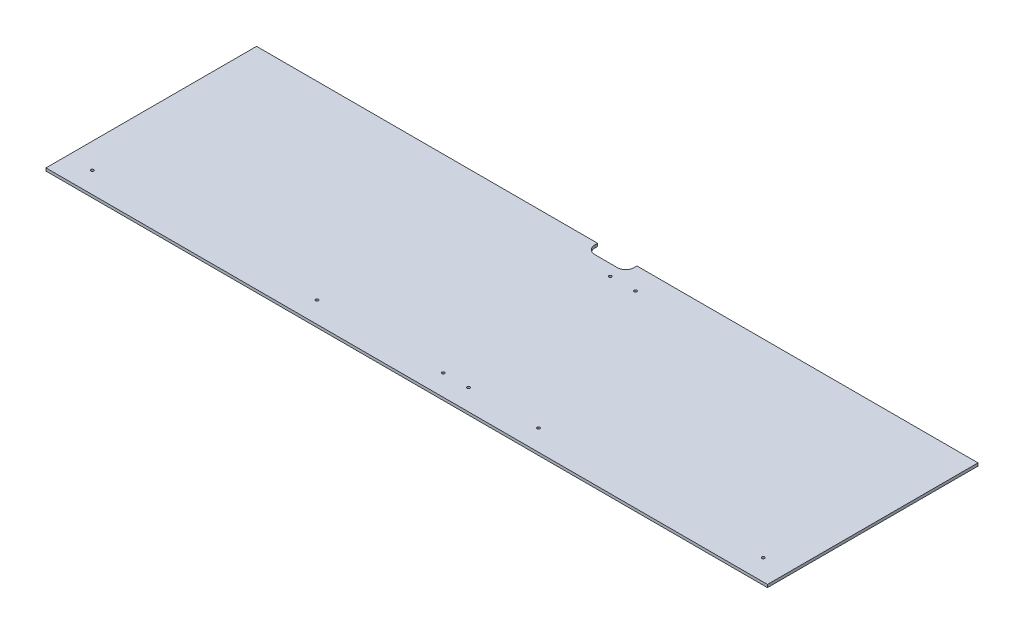
ISO-10303-21;
HEADER;
FILE_DESCRIPTION(('STEP AP214'),'2;1');
FILE_NAME('part.step','',(''),(''),'','','');
FILE_SCHEMA(('AUTOMOTIVE_DESIGN { 1 0 10303 214 1 1 1 1 }'));
ENDSEC;
DATA;
#1=APPLICATION_CONTEXT('core data for automotive mechanical design processes');
#2=APPLICATION_PROTOCOL_DEFINITION('international standard','automotive_design',2000,#1);
#3=PRODUCT_CONTEXT('',#1,'mechanical');
#4=PRODUCT('Part','Part','',(#3));
#5=PRODUCT_RELATED_PRODUCT_CATEGORY('part','',(#4));
#6=PRODUCT_DEFINITION_FORMATION('','',#4);
#7=PRODUCT_DEFINITION_CONTEXT('part definition',#1,'design');
#8=PRODUCT_DEFINITION('design','',#6,#7);
#9=PRODUCT_DEFINITION_SHAPE('','',#8);
#10=(LENGTH_UNIT() NAMED_UNIT(*) SI_UNIT(.MILLI.,.METRE.));
#11=(NAMED_UNIT(*) PLANE_ANGLE_UNIT() SI_UNIT($,.RADIAN.));
#12=(NAMED_UNIT(*) SI_UNIT($,.STERADIAN.) SOLID_ANGLE_UNIT());
#13=UNCERTAINTY_MEASURE_WITH_UNIT(LENGTH_MEASURE(1.E-05),#10,'distance_accuracy_value','');
#14=(GEOMETRIC_REPRESENTATION_CONTEXT(3) GLOBAL_UNCERTAINTY_ASSIGNED_CONTEXT((#13)) GLOBAL_UNIT_ASSIGNED_CONTEXT((#10,
#11,#12)) REPRESENTATION_CONTEXT('',''));
#15=CARTESIAN_POINT('',(0.,0.,0.));
#16=DIRECTION('',(0.,0.,1.));
#17=DIRECTION('',(1.,0.,0.));
#18=AXIS2_PLACEMENT_3D('',#15,#16,#17);
#19=CARTESIAN_POINT('',(815.975,-6.35,238.125));
#20=DIRECTION('',(0.,-1.,0.));
#21=DIRECTION('',(0.,0.,-1.));
#22=AXIS2_PLACEMENT_3D('',#19,#20,#21);
#23=PLANE('',#22);
#24=DIRECTION('',(-1.,0.,0.));
#25=VECTOR('',#24,1.);
#26=CARTESIAN_POINT('',(818.778398267125,-6.35,25.4));
#27=LINE('',#26,#25);
#28=CARTESIAN_POINT('',(841.375,-6.35,25.4));
#29=VERTEX_POINT('',#28);
#30=CARTESIAN_POINT('',(790.575,-6.35,25.4));
#31=VERTEX_POINT('',#30);
#32=EDGE_CURVE('E92',#29,#31,#27,.T.);
#33=ORIENTED_EDGE('',*,*,#32,.F.);
#34=CARTESIAN_POINT('',(841.375,-6.35,6.35));
#35=DIRECTION('',(0.,1.,0.));
#36=DIRECTION('',(0.,0.,1.));
#37=AXIS2_PLACEMENT_3D('',#34,#35,#36);
#38=CIRCLE('',#37,19.05);
#39=CARTESIAN_POINT('',(860.425,-6.35,6.35));
#40=VERTEX_POINT('',#39);
#41=EDGE_CURVE('E112',#29,#40,#38,.T.);
#42=ORIENTED_EDGE('',*,*,#41,.T.);
#43=DIRECTION('',(0.,0.,-1.));
#44=VECTOR('',#43,1.);
#45=CARTESIAN_POINT('',(860.425,-6.35,12.7));
#46=LINE('',#45,#44);
#47=CARTESIAN_POINT('',(860.425,-6.35,0.));
#48=VERTEX_POINT('',#47);
#49=EDGE_CURVE('E165',#40,#48,#46,.T.);
#50=ORIENTED_EDGE('',*,*,#49,.T.);
#51=DIRECTION('',(1.,0.,0.));
#52=VECTOR('',#51,1.);
#53=CARTESIAN_POINT('',(815.975,-6.35,0.));
#54=LINE('',#53,#52);
#55=CARTESIAN_POINT('',(1631.95,-6.35,0.));
#56=VERTEX_POINT('',#55);
#57=EDGE_CURVE('E162',#48,#56,#54,.T.);
#58=ORIENTED_EDGE('',*,*,#57,.T.);
#59=DIRECTION('',(0.,0.,1.));
#60=VECTOR('',#59,1.);
#61=CARTESIAN_POINT('',(1631.95,-6.35,238.125));
#62=LINE('',#61,#60);
#63=CARTESIAN_POINT('',(1631.95,-6.35,476.25));
#64=VERTEX_POINT('',#63);
#65=EDGE_CURVE('E175',#56,#64,#62,.T.);
#66=ORIENTED_EDGE('',*,*,#65,.T.);
#67=DIRECTION('',(1.,0.,0.));
#68=VECTOR('',#67,1.);
#69=CARTESIAN_POINT('',(815.975,-6.35,476.25));
#70=LINE('',#69,#68);
#71=CARTESIAN_POINT('',(0.,-6.35,476.25));
#72=VERTEX_POINT('',#71);
#73=EDGE_CURVE('E151',#72,#64,#70,.T.);
#74=ORIENTED_EDGE('',*,*,#73,.F.);
#75=DIRECTION('',(0.,0.,1.));
#76=VECTOR('',#75,1.);
#77=CARTESIAN_POINT('',(0.,-6.35,238.125));
#78=LINE('',#77,#76);
#79=CARTESIAN_POINT('',(0.,-6.35,0.));
#80=VERTEX_POINT('',#79);
#81=EDGE_CURVE('E141',#80,#72,#78,.T.);
#82=ORIENTED_EDGE('',*,*,#81,.F.);
#83=DIRECTION('',(1.,0.,0.));
#84=VECTOR('',#83,1.);
#85=CARTESIAN_POINT('',(815.975,-6.35,0.));
#86=LINE('',#85,#84);
#87=CARTESIAN_POINT('',(771.525,-6.35,0.));
#88=VERTEX_POINT('',#87);
#89=EDGE_CURVE('E131',#80,#88,#86,.T.);
#90=ORIENTED_EDGE('',*,*,#89,.T.);
#91=DIRECTION('',(0.,0.,-1.));
#92=VECTOR('',#91,1.);
#93=CARTESIAN_POINT('',(771.525,-6.35,12.7));
#94=LINE('',#93,#92);
#95=CARTESIAN_POINT('',(771.525,-6.35,6.35));
#96=VERTEX_POINT('',#95);
#97=EDGE_CURVE('E87',#96,#88,#94,.T.);
#98=ORIENTED_EDGE('',*,*,#97,.F.);
#99=CARTESIAN_POINT('',(790.575,-6.35,6.35));
#100=DIRECTION('',(0.,-1.,0.));
#101=DIRECTION('',(0.,0.,-1.));
#102=AXIS2_PLACEMENT_3D('',#99,#100,#101);
#103=CIRCLE('',#102,19.05);
#104=EDGE_CURVE('E100',#96,#31,#103,.F.);
#105=ORIENTED_EDGE('',*,*,#104,.T.);
#106=EDGE_LOOP('',(#33,#42,#50,#58,#66,#74,#82,#90,#98,#105));
#107=FACE_BOUND('',#106,.T.);
#108=CARTESIAN_POINT('',(57.15,-6.3500000000003,428.625));
#109=DIRECTION('',(0.,-1.,0.));
#110=DIRECTION('',(0.,0.,-1.));
#111=AXIS2_PLACEMENT_3D('',#108,#109,#110);
#112=CIRCLE('',#111,3.175);
#113=CARTESIAN_POINT('',(57.15,-6.3500000000003,425.45));
#114=VERTEX_POINT('',#113);
#115=EDGE_CURVE('E178',#114,#114,#112,.F.);
#116=ORIENTED_EDGE('',*,*,#115,.T.);
#117=EDGE_LOOP('',(#116));
#118=FACE_BOUND('',#117,.T.);
#119=CARTESIAN_POINT('',(565.15,-6.3500000000003,428.625));
#120=DIRECTION('',(0.,-1.,0.));
#121=DIRECTION('',(0.,0.,-1.));
#122=AXIS2_PLACEMENT_3D('',#119,#120,#121);
#123=CIRCLE('',#122,3.175);
#124=CARTESIAN_POINT('',(565.15,-6.3500000000003,425.45));
#125=VERTEX_POINT('',#124);
#126=EDGE_CURVE('E224',#125,#125,#123,.F.);
#127=ORIENTED_EDGE('',*,*,#126,.T.);
#128=EDGE_LOOP('',(#127));
#129=FACE_BOUND('',#128,.T.);
#130=CARTESIAN_POINT('',(850.9,-6.3500000000003,428.625));
#131=DIRECTION('',(0.,-1.,0.));
#132=DIRECTION('',(0.,0.,-1.));
#133=AXIS2_PLACEMENT_3D('',#130,#131,#132);
#134=CIRCLE('',#133,3.175);
#135=CARTESIAN_POINT('',(850.9,-6.3500000000003,425.45));
#136=VERTEX_POINT('',#135);
#137=EDGE_CURVE('E227',#136,#136,#134,.F.);
#138=ORIENTED_EDGE('',*,*,#137,.T.);
#139=EDGE_LOOP('',(#138));
#140=FACE_BOUND('',#139,.T.);
#141=CARTESIAN_POINT('',(908.05,-6.3500000000003,428.625));
#142=DIRECTION('',(0.,-1.,0.));
#143=DIRECTION('',(0.,0.,-1.));
#144=AXIS2_PLACEMENT_3D('',#141,#142,#143);
#145=CIRCLE('',#144,3.175);
#146=CARTESIAN_POINT('',(908.05,-6.3500000000003,425.45));
#147=VERTEX_POINT('',#146);
#148=EDGE_CURVE('E230',#147,#147,#145,.F.);
#149=ORIENTED_EDGE('',*,*,#148,.T.);
#150=EDGE_LOOP('',(#149));
#151=FACE_BOUND('',#150,.T.);
#152=CARTESIAN_POINT('',(1066.8,-6.3500000000003,428.625));
#153=DIRECTION('',(0.,-1.,0.));
#154=DIRECTION('',(0.,0.,-1.));
#155=AXIS2_PLACEMENT_3D('',#152,#153,#154);
#156=CIRCLE('',#155,3.175);
#157=CARTESIAN_POINT('',(1066.8,-6.3500000000003,425.45));
#158=VERTEX_POINT('',#157);
#159=EDGE_CURVE('E233',#158,#158,#156,.F.);
#160=ORIENTED_EDGE('',*,*,#159,.T.);
#161=EDGE_LOOP('',(#160));
#162=FACE_BOUND('',#161,.T.);
#163=CARTESIAN_POINT('',(1574.8,-6.3500000000003,428.625));
#164=DIRECTION('',(0.,-1.,0.));
#165=DIRECTION('',(0.,0.,-1.));
#166=AXIS2_PLACEMENT_3D('',#163,#164,#165);
#167=CIRCLE('',#166,3.175);
#168=CARTESIAN_POINT('',(1574.8,-6.3500000000003,425.45));
#169=VERTEX_POINT('',#168);
#170=EDGE_CURVE('E236',#169,#169,#167,.F.);
#171=ORIENTED_EDGE('',*,*,#170,.T.);
#172=EDGE_LOOP('',(#171));
#173=FACE_BOUND('',#172,.T.);
#174=CARTESIAN_POINT('',(908.05,-6.3500000000003,50.8));
#175=DIRECTION('',(0.,-1.,0.));
#176=DIRECTION('',(0.,0.,-1.));
#177=AXIS2_PLACEMENT_3D('',#174,#175,#176);
#178=CIRCLE('',#177,3.175);
#179=CARTESIAN_POINT('',(908.05,-6.3500000000003,47.625));
#180=VERTEX_POINT('',#179);
#181=EDGE_CURVE('E238',#180,#180,#178,.F.);
#182=ORIENTED_EDGE('',*,*,#181,.T.);
#183=EDGE_LOOP('',(#182));
#184=FACE_BOUND('',#183,.T.);
#185=CARTESIAN_POINT('',(850.9,-6.3500000000003,50.8));
#186=DIRECTION('',(0.,-1.,0.));
#187=DIRECTION('',(0.,0.,-1.));
#188=AXIS2_PLACEMENT_3D('',#185,#186,#187);
#189=CIRCLE('',#188,3.175);
#190=CARTESIAN_POINT('',(850.9,-6.3500000000003,47.625));
#191=VERTEX_POINT('',#190);
#192=EDGE_CURVE('E17',#191,#191,#189,.F.);
#193=ORIENTED_EDGE('',*,*,#192,.T.);
#194=EDGE_LOOP('',(#193));
#195=FACE_BOUND('',#194,.T.);
#196=ADVANCED_FACE('F14',(#107,#118,#129,#140,#151,#162,#173,#184,#195),#23,.T.);
#197=CARTESIAN_POINT('',(850.9,-7227.09274295138,50.8));
#198=DIRECTION('',(0.,-1.,0.));
#199=DIRECTION('',(0.,0.,-1.));
#200=AXIS2_PLACEMENT_3D('',#197,#198,#199);
#201=CYLINDRICAL_SURFACE('',#200,3.175);
#202=CARTESIAN_POINT('',(850.9,0.,50.8));
#203=DIRECTION('',(0.,-1.,0.));
#204=DIRECTION('',(0.,0.,-1.));
#205=AXIS2_PLACEMENT_3D('',#202,#203,#204);
#206=CIRCLE('',#205,3.175);
#207=CARTESIAN_POINT('',(850.9,0.,47.625));
#208=VERTEX_POINT('',#207);
#209=EDGE_CURVE('E218',#208,#208,#206,.F.);
#210=ORIENTED_EDGE('',*,*,#209,.T.);
#211=EDGE_LOOP('',(#210));
#212=FACE_BOUND('',#211,.T.);
#213=ORIENTED_EDGE('',*,*,#192,.F.);
#214=EDGE_LOOP('',(#213));
#215=FACE_BOUND('',#214,.T.);
#216=ADVANCED_FACE('F246',(#212,#215),#201,.F.);
#217=CARTESIAN_POINT('',(908.05,-7227.09274295138,50.8));
#218=DIRECTION('',(0.,-1.,0.));
#219=DIRECTION('',(0.,0.,-1.));
#220=AXIS2_PLACEMENT_3D('',#217,#218,#219);
#221=CYLINDRICAL_SURFACE('',#220,3.175);
#222=CARTESIAN_POINT('',(908.05,0.,50.8));
#223=DIRECTION('',(0.,-1.,0.));
#224=DIRECTION('',(0.,0.,-1.));
#225=AXIS2_PLACEMENT_3D('',#222,#223,#224);
#226=CIRCLE('',#225,3.175);
#227=CARTESIAN_POINT('',(908.05,0.,47.625));
#228=VERTEX_POINT('',#227);
#229=EDGE_CURVE('E215',#228,#228,#226,.F.);
#230=ORIENTED_EDGE('',*,*,#229,.T.);
#231=EDGE_LOOP('',(#230));
#232=FACE_BOUND('',#231,.T.);
#233=ORIENTED_EDGE('',*,*,#181,.F.);
#234=EDGE_LOOP('',(#233));
#235=FACE_BOUND('',#234,.T.);
#236=ADVANCED_FACE('F248',(#232,#235),#221,.F.);
#237=CARTESIAN_POINT('',(1574.8,-7227.09274295138,428.625));
#238=DIRECTION('',(0.,-1.,0.));
#239=DIRECTION('',(0.,0.,-1.));
#240=AXIS2_PLACEMENT_3D('',#237,#238,#239);
#241=CYLINDRICAL_SURFACE('',#240,3.175);
#242=CARTESIAN_POINT('',(1574.8,0.,428.625));
#243=DIRECTION('',(0.,-1.,0.));
#244=DIRECTION('',(0.,0.,-1.));
#245=AXIS2_PLACEMENT_3D('',#242,#243,#244);
#246=CIRCLE('',#245,3.175);
#247=CARTESIAN_POINT('',(1574.8,0.,425.45));
#248=VERTEX_POINT('',#247);
#249=EDGE_CURVE('E212',#248,#248,#246,.F.);
#250=ORIENTED_EDGE('',*,*,#249,.T.);
#251=EDGE_LOOP('',(#250));
#252=FACE_BOUND('',#251,.T.);
#253=ORIENTED_EDGE('',*,*,#170,.F.);
#254=EDGE_LOOP('',(#253));
#255=FACE_BOUND('',#254,.T.);
#256=ADVANCED_FACE('F255',(#252,#255),#241,.F.);
#257=CARTESIAN_POINT('',(1066.8,-7227.09274295138,428.625));
#258=DIRECTION('',(0.,-1.,0.));
#259=DIRECTION('',(0.,0.,-1.));
#260=AXIS2_PLACEMENT_3D('',#257,#258,#259);
#261=CYLINDRICAL_SURFACE('',#260,3.175);
#262=CARTESIAN_POINT('',(1066.8,0.,428.625));
#263=DIRECTION('',(0.,-1.,0.));
#264=DIRECTION('',(0.,0.,-1.));
#265=AXIS2_PLACEMENT_3D('',#262,#263,#264);
#266=CIRCLE('',#265,3.175);
#267=CARTESIAN_POINT('',(1066.8,0.,425.45));
#268=VERTEX_POINT('',#267);
#269=EDGE_CURVE('E209',#268,#268,#266,.F.);
#270=ORIENTED_EDGE('',*,*,#269,.T.);
#271=EDGE_LOOP('',(#270));
#272=FACE_BOUND('',#271,.T.);
#273=ORIENTED_EDGE('',*,*,#159,.F.);
#274=EDGE_LOOP('',(#273));
#275=FACE_BOUND('',#274,.T.);
#276=ADVANCED_FACE('F317',(#272,#275),#261,.F.);
#277=CARTESIAN_POINT('',(908.05,-7227.09274295138,428.625));
#278=DIRECTION('',(0.,-1.,0.));
#279=DIRECTION('',(0.,0.,-1.));
#280=AXIS2_PLACEMENT_3D('',#277,#278,#279);
#281=CYLINDRICAL_SURFACE('',#280,3.175);
#282=CARTESIAN_POINT('',(908.05,0.,428.625));
#283=DIRECTION('',(0.,-1.,0.));
#284=DIRECTION('',(0.,0.,-1.));
#285=AXIS2_PLACEMENT_3D('',#282,#283,#284);
#286=CIRCLE('',#285,3.175);
#287=CARTESIAN_POINT('',(908.05,0.,425.45));
#288=VERTEX_POINT('',#287);
#289=EDGE_CURVE('E206',#288,#288,#286,.F.);
#290=ORIENTED_EDGE('',*,*,#289,.T.);
#291=EDGE_LOOP('',(#290));
#292=FACE_BOUND('',#291,.T.);
#293=ORIENTED_EDGE('',*,*,#148,.F.);
#294=EDGE_LOOP('',(#293));
#295=FACE_BOUND('',#294,.T.);
#296=ADVANCED_FACE('F313',(#292,#295),#281,.F.);
#297=CARTESIAN_POINT('',(850.9,-7227.09274295138,428.625));
#298=DIRECTION('',(0.,-1.,0.));
#299=DIRECTION('',(0.,0.,-1.));
#300=AXIS2_PLACEMENT_3D('',#297,#298,#299);
#301=CYLINDRICAL_SURFACE('',#300,3.175);
#302=CARTESIAN_POINT('',(850.9,0.,428.625));
#303=DIRECTION('',(0.,-1.,0.));
#304=DIRECTION('',(0.,0.,-1.));
#305=AXIS2_PLACEMENT_3D('',#302,#303,#304);
#306=CIRCLE('',#305,3.175);
#307=CARTESIAN_POINT('',(850.9,0.,425.45));
#308=VERTEX_POINT('',#307);
#309=EDGE_CURVE('E203',#308,#308,#306,.F.);
#310=ORIENTED_EDGE('',*,*,#309,.T.);
#311=EDGE_LOOP('',(#310));
#312=FACE_BOUND('',#311,.T.);
#313=ORIENTED_EDGE('',*,*,#137,.F.);
#314=EDGE_LOOP('',(#313));
#315=FACE_BOUND('',#314,.T.);
#316=ADVANCED_FACE('F309',(#312,#315),#301,.F.);
#317=CARTESIAN_POINT('',(565.15,-7227.09274295138,428.625));
#318=DIRECTION('',(0.,-1.,0.));
#319=DIRECTION('',(0.,0.,-1.));
#320=AXIS2_PLACEMENT_3D('',#317,#318,#319);
#321=CYLINDRICAL_SURFACE('',#320,3.175);
#322=CARTESIAN_POINT('',(565.15,0.,428.625));
#323=DIRECTION('',(0.,-1.,0.));
#324=DIRECTION('',(0.,0.,-1.));
#325=AXIS2_PLACEMENT_3D('',#322,#323,#324);
#326=CIRCLE('',#325,3.175);
#327=CARTESIAN_POINT('',(565.15,0.,425.45));
#328=VERTEX_POINT('',#327);
#329=EDGE_CURVE('E200',#328,#328,#326,.F.);
#330=ORIENTED_EDGE('',*,*,#329,.T.);
#331=EDGE_LOOP('',(#330));
#332=FACE_BOUND('',#331,.T.);
#333=ORIENTED_EDGE('',*,*,#126,.F.);
#334=EDGE_LOOP('',(#333));
#335=FACE_BOUND('',#334,.T.);
#336=ADVANCED_FACE('F305',(#332,#335),#321,.F.);
#337=CARTESIAN_POINT('',(57.15,-7227.09274295138,428.625));
#338=DIRECTION('',(0.,-1.,0.));
#339=DIRECTION('',(0.,0.,-1.));
#340=AXIS2_PLACEMENT_3D('',#337,#338,#339);
#341=CYLINDRICAL_SURFACE('',#340,3.175);
#342=CARTESIAN_POINT('',(57.15,0.,428.625));
#343=DIRECTION('',(0.,-1.,0.));
#344=DIRECTION('',(0.,0.,-1.));
#345=AXIS2_PLACEMENT_3D('',#342,#343,#344);
#346=CIRCLE('',#345,3.175);
#347=CARTESIAN_POINT('',(57.15,0.,425.45));
#348=VERTEX_POINT('',#347);
#349=EDGE_CURVE('E156',#348,#348,#346,.F.);
#350=ORIENTED_EDGE('',*,*,#349,.T.);
#351=EDGE_LOOP('',(#350));
#352=FACE_BOUND('',#351,.T.);
#353=ORIENTED_EDGE('',*,*,#115,.F.);
#354=EDGE_LOOP('',(#353));
#355=FACE_BOUND('',#354,.T.);
#356=ADVANCED_FACE('F301',(#352,#355),#341,.F.);
#357=CARTESIAN_POINT('',(1631.95,-6.35,238.125));
#358=DIRECTION('',(-1.,0.,0.));
#359=DIRECTION('',(0.,0.,1.));
#360=AXIS2_PLACEMENT_3D('',#357,#358,#359);
#361=PLANE('',#360);
#362=DIRECTION('',(0.,1.,0.));
#363=VECTOR('',#362,1.);
#364=CARTESIAN_POINT('',(1631.95,-6.35,476.25));
#365=LINE('',#364,#363);
#366=CARTESIAN_POINT('',(1631.95,0.,476.25));
#367=VERTEX_POINT('',#366);
#368=EDGE_CURVE('E149',#64,#367,#365,.T.);
#369=ORIENTED_EDGE('',*,*,#368,.F.);
#370=ORIENTED_EDGE('',*,*,#65,.F.);
#371=DIRECTION('',(0.,1.,0.));
#372=VECTOR('',#371,1.);
#373=CARTESIAN_POINT('',(1631.95,-6.35,0.));
#374=LINE('',#373,#372);
#375=CARTESIAN_POINT('',(1631.95,0.,0.));
#376=VERTEX_POINT('',#375);
#377=EDGE_CURVE('E159',#56,#376,#374,.T.);
#378=ORIENTED_EDGE('',*,*,#377,.T.);
#379=DIRECTION('',(0.,0.,-1.));
#380=VECTOR('',#379,1.);
#381=CARTESIAN_POINT('',(1631.95,0.,238.125));
#382=LINE('',#381,#380);
#383=EDGE_CURVE('E146',#376,#367,#382,.F.);
#384=ORIENTED_EDGE('',*,*,#383,.T.);
#385=EDGE_LOOP('',(#369,#370,#378,#384));
#386=FACE_BOUND('',#385,.T.);
#387=ADVANCED_FACE('F297',(#386),#361,.F.);
#388=CARTESIAN_POINT('',(815.975,-6.35,476.25));
#389=DIRECTION('',(0.,0.,1.));
#390=DIRECTION('',(1.,0.,0.));
#391=AXIS2_PLACEMENT_3D('',#388,#389,#390);
#392=PLANE('',#391);
#393=ORIENTED_EDGE('',*,*,#73,.T.);
#394=ORIENTED_EDGE('',*,*,#368,.T.);
#395=DIRECTION('',(1.,0.,0.));
#396=VECTOR('',#395,1.);
#397=CARTESIAN_POINT('',(815.975,0.,476.25));
#398=LINE('',#397,#396);
#399=CARTESIAN_POINT('',(0.,0.,476.25));
#400=VERTEX_POINT('',#399);
#401=EDGE_CURVE('E137',#367,#400,#398,.F.);
#402=ORIENTED_EDGE('',*,*,#401,.T.);
#403=DIRECTION('',(0.,1.,0.));
#404=VECTOR('',#403,1.);
#405=CARTESIAN_POINT('',(0.,-6.35,476.25));
#406=LINE('',#405,#404);
#407=EDGE_CURVE('E132',#72,#400,#406,.T.);
#408=ORIENTED_EDGE('',*,*,#407,.F.);
#409=EDGE_LOOP('',(#393,#394,#402,#408));
#410=FACE_BOUND('',#409,.T.);
#411=ADVANCED_FACE('F293',(#410),#392,.T.);
#412=CARTESIAN_POINT('',(0.,-6.35,238.125));
#413=DIRECTION('',(-1.,0.,0.));
#414=DIRECTION('',(0.,0.,1.));
#415=AXIS2_PLACEMENT_3D('',#412,#413,#414);
#416=PLANE('',#415);
#417=ORIENTED_EDGE('',*,*,#81,.T.);
#418=ORIENTED_EDGE('',*,*,#407,.T.);
#419=DIRECTION('',(0.,0.,-1.));
#420=VECTOR('',#419,1.);
#421=CARTESIAN_POINT('',(-1.11022302462516E-13,0.,238.125));
#422=LINE('',#421,#420);
#423=CARTESIAN_POINT('',(0.,0.,0.));
#424=VERTEX_POINT('',#423);
#425=EDGE_CURVE('E125',#400,#424,#422,.T.);
#426=ORIENTED_EDGE('',*,*,#425,.T.);
#427=DIRECTION('',(0.,1.,0.));
#428=VECTOR('',#427,1.);
#429=CARTESIAN_POINT('',(0.,-6.35,0.));
#430=LINE('',#429,#428);
#431=EDGE_CURVE('E128',#424,#80,#430,.F.);
#432=ORIENTED_EDGE('',*,*,#431,.T.);
#433=EDGE_LOOP('',(#417,#418,#426,#432));
#434=FACE_BOUND('',#433,.T.);
#435=ADVANCED_FACE('F289',(#434),#416,.T.);
#436=CARTESIAN_POINT('',(815.975,-6.35,0.));
#437=DIRECTION('',(0.,0.,1.));
#438=DIRECTION('',(1.,0.,0.));
#439=AXIS2_PLACEMENT_3D('',#436,#437,#438);
#440=PLANE('',#439);
#441=DIRECTION('',(0.,1.,0.));
#442=VECTOR('',#441,1.);
#443=CARTESIAN_POINT('',(771.525,19.05,0.));
#444=LINE('',#443,#442);
#445=CARTESIAN_POINT('',(771.525,0.,0.));
#446=VERTEX_POINT('',#445);
#447=EDGE_CURVE('E117',#88,#446,#444,.T.);
#448=ORIENTED_EDGE('',*,*,#447,.F.);
#449=ORIENTED_EDGE('',*,*,#89,.F.);
#450=ORIENTED_EDGE('',*,*,#431,.F.);
#451=DIRECTION('',(1.,0.,0.));
#452=VECTOR('',#451,1.);
#453=CARTESIAN_POINT('',(815.975,0.,0.));
#454=LINE('',#453,#452);
#455=EDGE_CURVE('E121',#424,#446,#454,.T.);
#456=ORIENTED_EDGE('',*,*,#455,.T.);
#457=EDGE_LOOP('',(#448,#449,#450,#456));
#458=FACE_BOUND('',#457,.T.);
#459=ADVANCED_FACE('F285',(#458),#440,.F.);
#460=CARTESIAN_POINT('',(771.525,19.05,12.7));
#461=DIRECTION('',(1.,0.,0.));
#462=DIRECTION('',(0.,0.,-1.));
#463=AXIS2_PLACEMENT_3D('',#460,#461,#462);
#464=PLANE('',#463);
#465=ORIENTED_EDGE('',*,*,#97,.T.);
#466=ORIENTED_EDGE('',*,*,#447,.T.);
#467=DIRECTION('',(0.,0.,-1.));
#468=VECTOR('',#467,1.);
#469=CARTESIAN_POINT('',(771.525,0.,238.125));
#470=LINE('',#469,#468);
#471=CARTESIAN_POINT('',(771.525,0.,6.35));
#472=VERTEX_POINT('',#471);
#473=EDGE_CURVE('E124',#446,#472,#470,.F.);
#474=ORIENTED_EDGE('',*,*,#473,.T.);
#475=DIRECTION('',(0.,-1.,0.));
#476=VECTOR('',#475,1.);
#477=CARTESIAN_POINT('',(771.525,19.05,6.35));
#478=LINE('',#477,#476);
#479=EDGE_CURVE('E105',#472,#96,#478,.T.);
#480=ORIENTED_EDGE('',*,*,#479,.T.);
#481=EDGE_LOOP('',(#465,#466,#474,#480));
#482=FACE_BOUND('',#481,.T.);
#483=ADVANCED_FACE('F282',(#482),#464,.T.);
#484=CARTESIAN_POINT('',(790.575,19.05,6.35));
#485=DIRECTION('',(0.,-1.,0.));
#486=DIRECTION('',(0.,0.,-1.));
#487=AXIS2_PLACEMENT_3D('',#484,#485,#486);
#488=CYLINDRICAL_SURFACE('',#487,19.05);
#489=DIRECTION('',(0.,1.,0.));
#490=VECTOR('',#489,1.);
#491=CARTESIAN_POINT('',(790.575,19.05,25.4));
#492=LINE('',#491,#490);
#493=CARTESIAN_POINT('',(790.575,0.,25.4));
#494=VERTEX_POINT('',#493);
#495=EDGE_CURVE('E96',#31,#494,#492,.T.);
#496=ORIENTED_EDGE('',*,*,#495,.F.);
#497=ORIENTED_EDGE('',*,*,#104,.F.);
#498=ORIENTED_EDGE('',*,*,#479,.F.);
#499=CARTESIAN_POINT('',(790.575,0.,6.35));
#500=DIRECTION('',(0.,-1.,0.));
#501=DIRECTION('',(0.,0.,-1.));
#502=AXIS2_PLACEMENT_3D('',#499,#500,#501);
#503=CIRCLE('',#502,19.05);
#504=EDGE_CURVE('E110',#472,#494,#503,.F.);
#505=ORIENTED_EDGE('',*,*,#504,.T.);
#506=EDGE_LOOP('',(#496,#497,#498,#505));
#507=FACE_BOUND('',#506,.T.);
#508=ADVANCED_FACE('F108',(#507),#488,.F.);
#509=CARTESIAN_POINT('',(818.778398267125,19.05,25.4));
#510=DIRECTION('',(0.,0.,-1.));
#511=DIRECTION('',(-1.,0.,0.));
#512=AXIS2_PLACEMENT_3D('',#509,#510,#511);
#513=PLANE('',#512);
#514=ORIENTED_EDGE('',*,*,#32,.T.);
#515=ORIENTED_EDGE('',*,*,#495,.T.);
#516=DIRECTION('',(1.,0.,0.));
#517=VECTOR('',#516,1.);
#518=CARTESIAN_POINT('',(815.975,0.,25.4));
#519=LINE('',#518,#517);
#520=CARTESIAN_POINT('',(841.375,0.,25.4));
#521=VERTEX_POINT('',#520);
#522=EDGE_CURVE('E196',#494,#521,#519,.T.);
#523=ORIENTED_EDGE('',*,*,#522,.T.);
#524=DIRECTION('',(0.,1.,0.));
#525=VECTOR('',#524,1.);
#526=CARTESIAN_POINT('',(841.375,19.05,25.4));
#527=LINE('',#526,#525);
#528=EDGE_CURVE('E98',#521,#29,#527,.F.);
#529=ORIENTED_EDGE('',*,*,#528,.T.);
#530=EDGE_LOOP('',(#514,#515,#523,#529));
#531=FACE_BOUND('',#530,.T.);
#532=ADVANCED_FACE('F93',(#531),#513,.T.);
#533=CARTESIAN_POINT('',(841.375,19.05,6.35));
#534=DIRECTION('',(0.,1.,0.));
#535=DIRECTION('',(0.,0.,1.));
#536=AXIS2_PLACEMENT_3D('',#533,#534,#535);
#537=CYLINDRICAL_SURFACE('',#536,19.05);
#538=DIRECTION('',(0.,1.,0.));
#539=VECTOR('',#538,1.);
#540=CARTESIAN_POINT('',(860.425,19.05,6.35));
#541=LINE('',#540,#539);
#542=CARTESIAN_POINT('',(860.425,0.,6.35));
#543=VERTEX_POINT('',#542);
#544=EDGE_CURVE('E168',#543,#40,#541,.F.);
#545=ORIENTED_EDGE('',*,*,#544,.T.);
#546=ORIENTED_EDGE('',*,*,#41,.F.);
#547=ORIENTED_EDGE('',*,*,#528,.F.);
#548=CARTESIAN_POINT('',(841.375,0.,6.35));
#549=DIRECTION('',(0.,1.,0.));
#550=DIRECTION('',(0.,0.,1.));
#551=AXIS2_PLACEMENT_3D('',#548,#549,#550);
#552=CIRCLE('',#551,19.05);
#553=EDGE_CURVE('E193',#521,#543,#552,.T.);
#554=ORIENTED_EDGE('',*,*,#553,.T.);
#555=EDGE_LOOP('',(#545,#546,#547,#554));
#556=FACE_BOUND('',#555,.T.);
#557=ADVANCED_FACE('F273',(#556),#537,.F.);
#558=CARTESIAN_POINT('',(860.425,19.05,12.7));
#559=DIRECTION('',(1.,0.,0.));
#560=DIRECTION('',(0.,0.,-1.));
#561=AXIS2_PLACEMENT_3D('',#558,#559,#560);
#562=PLANE('',#561);
#563=ORIENTED_EDGE('',*,*,#544,.F.);
#564=DIRECTION('',(0.,0.,-1.));
#565=VECTOR('',#564,1.);
#566=CARTESIAN_POINT('',(860.425,0.,238.125));
#567=LINE('',#566,#565);
#568=CARTESIAN_POINT('',(860.425,0.,0.));
#569=VERTEX_POINT('',#568);
#570=EDGE_CURVE('E23',#543,#569,#567,.T.);
#571=ORIENTED_EDGE('',*,*,#570,.T.);
#572=DIRECTION('',(0.,1.,0.));
#573=VECTOR('',#572,1.);
#574=CARTESIAN_POINT('',(860.425,-6.35,0.));
#575=LINE('',#574,#573);
#576=EDGE_CURVE('E31',#569,#48,#575,.F.);
#577=ORIENTED_EDGE('',*,*,#576,.T.);
#578=ORIENTED_EDGE('',*,*,#49,.F.);
#579=EDGE_LOOP('',(#563,#571,#577,#578));
#580=FACE_BOUND('',#579,.T.);
#581=ADVANCED_FACE('F266',(#580),#562,.F.);
#582=CARTESIAN_POINT('',(815.975,-6.35,0.));
#583=DIRECTION('',(0.,0.,1.));
#584=DIRECTION('',(1.,0.,0.));
#585=AXIS2_PLACEMENT_3D('',#582,#583,#584);
#586=PLANE('',#585);
#587=DIRECTION('',(1.,0.,0.));
#588=VECTOR('',#587,1.);
#589=CARTESIAN_POINT('',(815.975,0.,0.));
#590=LINE('',#589,#588);
#591=EDGE_CURVE('E9',#569,#376,#590,.T.);
#592=ORIENTED_EDGE('',*,*,#591,.T.);
#593=ORIENTED_EDGE('',*,*,#377,.F.);
#594=ORIENTED_EDGE('',*,*,#57,.F.);
#595=ORIENTED_EDGE('',*,*,#576,.F.);
#596=EDGE_LOOP('',(#592,#593,#594,#595));
#597=FACE_BOUND('',#596,.T.);
#598=ADVANCED_FACE('F260',(#597),#586,.F.);
#599=CARTESIAN_POINT('',(815.975,0.,238.125));
#600=DIRECTION('',(0.,-1.,0.));
#601=DIRECTION('',(0.,0.,-1.));
#602=AXIS2_PLACEMENT_3D('',#599,#600,#601);
#603=PLANE('',#602);
#604=ORIENTED_EDGE('',*,*,#570,.F.);
#605=ORIENTED_EDGE('',*,*,#553,.F.);
#606=ORIENTED_EDGE('',*,*,#522,.F.);
#607=ORIENTED_EDGE('',*,*,#504,.F.);
#608=ORIENTED_EDGE('',*,*,#473,.F.);
#609=ORIENTED_EDGE('',*,*,#455,.F.);
#610=ORIENTED_EDGE('',*,*,#425,.F.);
#611=ORIENTED_EDGE('',*,*,#401,.F.);
#612=ORIENTED_EDGE('',*,*,#383,.F.);
#613=ORIENTED_EDGE('',*,*,#591,.F.);
#614=EDGE_LOOP('',(#604,#605,#606,#607,#608,#609,#610,#611,#612,#613));
#615=FACE_BOUND('',#614,.T.);
#616=ORIENTED_EDGE('',*,*,#349,.F.);
#617=EDGE_LOOP('',(#616));
#618=FACE_BOUND('',#617,.T.);
#619=ORIENTED_EDGE('',*,*,#329,.F.);
#620=EDGE_LOOP('',(#619));
#621=FACE_BOUND('',#620,.T.);
#622=ORIENTED_EDGE('',*,*,#309,.F.);
#623=EDGE_LOOP('',(#622));
#624=FACE_BOUND('',#623,.T.);
#625=ORIENTED_EDGE('',*,*,#289,.F.);
#626=EDGE_LOOP('',(#625));
#627=FACE_BOUND('',#626,.T.);
#628=ORIENTED_EDGE('',*,*,#269,.F.);
#629=EDGE_LOOP('',(#628));
#630=FACE_BOUND('',#629,.T.);
#631=ORIENTED_EDGE('',*,*,#249,.F.);
#632=EDGE_LOOP('',(#631));
#633=FACE_BOUND('',#632,.T.);
#634=ORIENTED_EDGE('',*,*,#229,.F.);
#635=EDGE_LOOP('',(#634));
#636=FACE_BOUND('',#635,.T.);
#637=ORIENTED_EDGE('',*,*,#209,.F.);
#638=EDGE_LOOP('',(#637));
#639=FACE_BOUND('',#638,.T.);
#640=ADVANCED_FACE('F258',(#615,#618,#621,#624,#627,#630,#633,#636,#639),#603,.F.);
#641=CLOSED_SHELL('',(#196,#216,#236,#256,#276,#296,#316,#336,#356,#387,#411,#435,#459,#483,
#508,#532,#557,#581,#598,#640));
#642=MANIFOLD_SOLID_BREP('B1',#641);
#643=ADVANCED_BREP_SHAPE_REPRESENTATION('',(#18,#642),#14);
#644=SHAPE_DEFINITION_REPRESENTATION(#9,#643);
ENDSEC;
END-ISO-10303-21;
